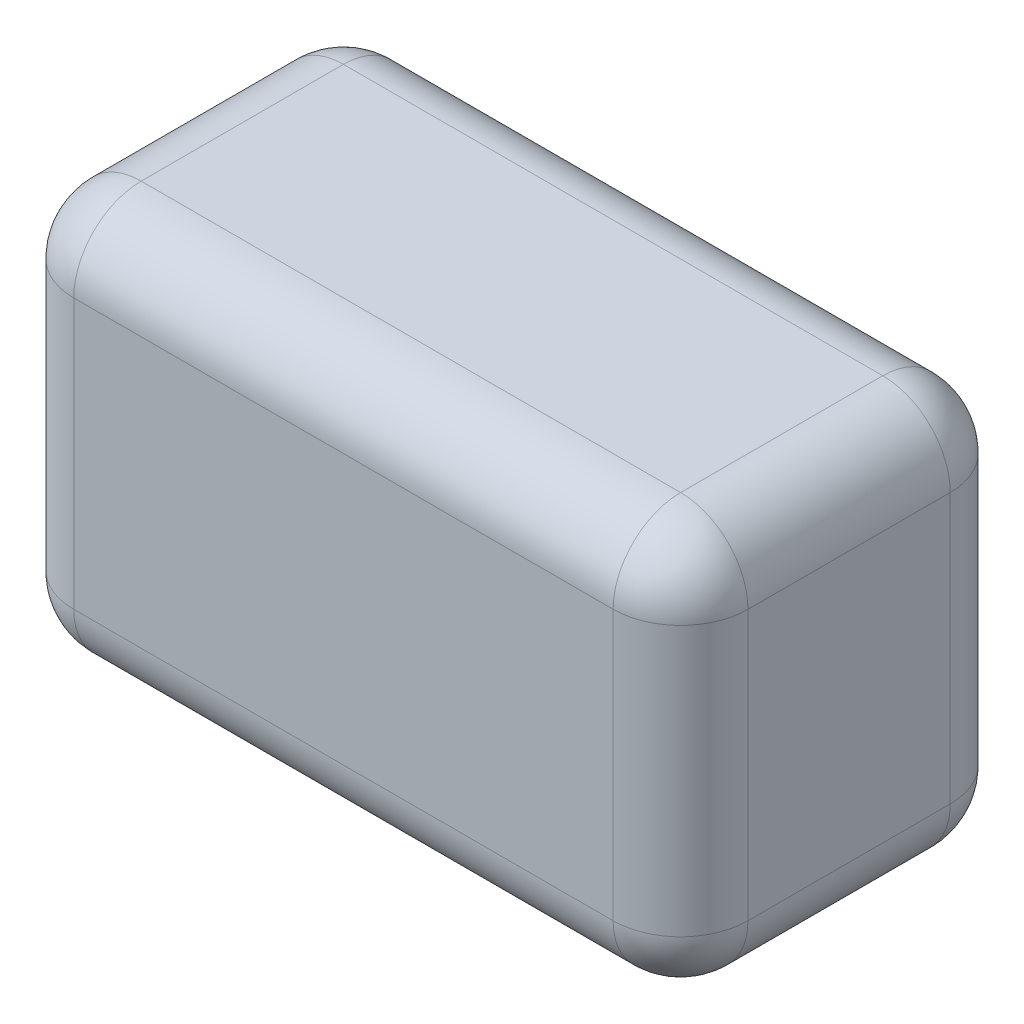
ISO-10303-21;
HEADER;
FILE_DESCRIPTION(('STEP AP214'),'2;1');
FILE_NAME('part.step','',(''),(''),'','','');
FILE_SCHEMA(('AUTOMOTIVE_DESIGN { 1 0 10303 214 1 1 1 1 }'));
ENDSEC;
DATA;
#1=APPLICATION_CONTEXT('core data for automotive mechanical design processes');
#2=APPLICATION_PROTOCOL_DEFINITION('international standard','automotive_design',2000,#1);
#3=PRODUCT_CONTEXT('',#1,'mechanical');
#4=PRODUCT('Part','Part','',(#3));
#5=PRODUCT_RELATED_PRODUCT_CATEGORY('part','',(#4));
#6=PRODUCT_DEFINITION_FORMATION('','',#4);
#7=PRODUCT_DEFINITION_CONTEXT('part definition',#1,'design');
#8=PRODUCT_DEFINITION('design','',#6,#7);
#9=PRODUCT_DEFINITION_SHAPE('','',#8);
#10=(LENGTH_UNIT() NAMED_UNIT(*) SI_UNIT(.MILLI.,.METRE.));
#11=(NAMED_UNIT(*) PLANE_ANGLE_UNIT() SI_UNIT($,.RADIAN.));
#12=(NAMED_UNIT(*) SI_UNIT($,.STERADIAN.) SOLID_ANGLE_UNIT());
#13=UNCERTAINTY_MEASURE_WITH_UNIT(LENGTH_MEASURE(1.E-05),#10,'distance_accuracy_value','');
#14=(GEOMETRIC_REPRESENTATION_CONTEXT(3) GLOBAL_UNCERTAINTY_ASSIGNED_CONTEXT((#13)) GLOBAL_UNIT_ASSIGNED_CONTEXT((#10,
#11,#12)) REPRESENTATION_CONTEXT('',''));
#15=CARTESIAN_POINT('',(0.,0.,0.));
#16=DIRECTION('',(0.,0.,1.));
#17=DIRECTION('',(1.,0.,0.));
#18=AXIS2_PLACEMENT_3D('',#15,#16,#17);
#19=CARTESIAN_POINT('',(127.,152.4,-63.5));
#20=DIRECTION('',(-1.,0.,0.));
#21=DIRECTION('',(0.,0.,1.));
#22=AXIS2_PLACEMENT_3D('',#19,#20,#21);
#23=PLANE('',#22);
#24=DIRECTION('',(0.,-1.,0.));
#25=VECTOR('',#24,1.);
#26=CARTESIAN_POINT('',(127.,152.4,38.1));
#27=LINE('',#26,#25);
#28=CARTESIAN_POINT('',(127.,127.,38.1));
#29=VERTEX_POINT('',#28);
#30=CARTESIAN_POINT('',(127.,25.4,38.1));
#31=VERTEX_POINT('',#30);
#32=EDGE_CURVE('E131',#29,#31,#27,.T.);
#33=ORIENTED_EDGE('',*,*,#32,.T.);
#34=DIRECTION('',(0.,0.,-1.));
#35=VECTOR('',#34,1.);
#36=CARTESIAN_POINT('',(127.,25.4,-63.5));
#37=LINE('',#36,#35);
#38=CARTESIAN_POINT('',(127.,25.4,-38.1));
#39=VERTEX_POINT('',#38);
#40=EDGE_CURVE('E176',#31,#39,#37,.T.);
#41=ORIENTED_EDGE('',*,*,#40,.T.);
#42=DIRECTION('',(0.,-1.,0.));
#43=VECTOR('',#42,1.);
#44=CARTESIAN_POINT('',(127.,152.4,-38.1));
#45=LINE('',#44,#43);
#46=CARTESIAN_POINT('',(127.,127.,-38.1));
#47=VERTEX_POINT('',#46);
#48=EDGE_CURVE('E134',#39,#47,#45,.F.);
#49=ORIENTED_EDGE('',*,*,#48,.T.);
#50=DIRECTION('',(0.,0.,-1.));
#51=VECTOR('',#50,1.);
#52=CARTESIAN_POINT('',(127.,127.,63.5));
#53=LINE('',#52,#51);
#54=EDGE_CURVE('E127',#47,#29,#53,.F.);
#55=ORIENTED_EDGE('',*,*,#54,.T.);
#56=EDGE_LOOP('',(#33,#41,#49,#55));
#57=FACE_BOUND('',#56,.T.);
#58=ADVANCED_FACE('F39',(#57),#23,.F.);
#59=CARTESIAN_POINT('',(-127.,152.4,-63.5));
#60=DIRECTION('',(0.,0.,1.));
#61=DIRECTION('',(1.,0.,0.));
#62=AXIS2_PLACEMENT_3D('',#59,#60,#61);
#63=PLANE('',#62);
#64=DIRECTION('',(-1.,0.,0.));
#65=VECTOR('',#64,1.);
#66=CARTESIAN_POINT('',(127.,127.,-63.5));
#67=LINE('',#66,#65);
#68=CARTESIAN_POINT('',(-101.6,127.,-63.5));
#69=VERTEX_POINT('',#68);
#70=CARTESIAN_POINT('',(101.6,127.,-63.5));
#71=VERTEX_POINT('',#70);
#72=EDGE_CURVE('E192',#69,#71,#67,.F.);
#73=ORIENTED_EDGE('',*,*,#72,.T.);
#74=DIRECTION('',(0.,-1.,0.));
#75=VECTOR('',#74,1.);
#76=CARTESIAN_POINT('',(101.6,152.4,-63.5));
#77=LINE('',#76,#75);
#78=CARTESIAN_POINT('',(101.6,25.4,-63.5));
#79=VERTEX_POINT('',#78);
#80=EDGE_CURVE('E201',#71,#79,#77,.T.);
#81=ORIENTED_EDGE('',*,*,#80,.T.);
#82=DIRECTION('',(-1.,0.,0.));
#83=VECTOR('',#82,1.);
#84=CARTESIAN_POINT('',(-127.,25.4,-63.5));
#85=LINE('',#84,#83);
#86=CARTESIAN_POINT('',(-101.6,25.4,-63.5));
#87=VERTEX_POINT('',#86);
#88=EDGE_CURVE('E198',#79,#87,#85,.T.);
#89=ORIENTED_EDGE('',*,*,#88,.T.);
#90=DIRECTION('',(0.,-1.,0.));
#91=VECTOR('',#90,1.);
#92=CARTESIAN_POINT('',(-101.6,152.4,-63.5));
#93=LINE('',#92,#91);
#94=EDGE_CURVE('E195',#87,#69,#93,.F.);
#95=ORIENTED_EDGE('',*,*,#94,.T.);
#96=EDGE_LOOP('',(#73,#81,#89,#95));
#97=FACE_BOUND('',#96,.T.);
#98=ADVANCED_FACE('F322',(#97),#63,.F.);
#99=CARTESIAN_POINT('',(-127.,152.4,-63.5));
#100=DIRECTION('',(1.,0.,0.));
#101=DIRECTION('',(0.,0.,-1.));
#102=AXIS2_PLACEMENT_3D('',#99,#100,#101);
#103=PLANE('',#102);
#104=DIRECTION('',(0.,0.,1.));
#105=VECTOR('',#104,1.);
#106=CARTESIAN_POINT('',(-127.,127.,-63.5));
#107=LINE('',#106,#105);
#108=CARTESIAN_POINT('',(-127.,127.,38.1));
#109=VERTEX_POINT('',#108);
#110=CARTESIAN_POINT('',(-127.,127.,-38.1));
#111=VERTEX_POINT('',#110);
#112=EDGE_CURVE('E208',#109,#111,#107,.F.);
#113=ORIENTED_EDGE('',*,*,#112,.T.);
#114=DIRECTION('',(0.,-1.,0.));
#115=VECTOR('',#114,1.);
#116=CARTESIAN_POINT('',(-127.,152.4,-38.1));
#117=LINE('',#116,#115);
#118=CARTESIAN_POINT('',(-127.,25.4,-38.1));
#119=VERTEX_POINT('',#118);
#120=EDGE_CURVE('E214',#111,#119,#117,.T.);
#121=ORIENTED_EDGE('',*,*,#120,.T.);
#122=DIRECTION('',(0.,0.,1.));
#123=VECTOR('',#122,1.);
#124=CARTESIAN_POINT('',(-127.,25.4,-63.5));
#125=LINE('',#124,#123);
#126=CARTESIAN_POINT('',(-127.,25.4,38.1));
#127=VERTEX_POINT('',#126);
#128=EDGE_CURVE('E211',#119,#127,#125,.T.);
#129=ORIENTED_EDGE('',*,*,#128,.T.);
#130=DIRECTION('',(0.,-1.,0.));
#131=VECTOR('',#130,1.);
#132=CARTESIAN_POINT('',(-127.,152.4,38.1));
#133=LINE('',#132,#131);
#134=EDGE_CURVE('E205',#127,#109,#133,.F.);
#135=ORIENTED_EDGE('',*,*,#134,.T.);
#136=EDGE_LOOP('',(#113,#121,#129,#135));
#137=FACE_BOUND('',#136,.T.);
#138=ADVANCED_FACE('F331',(#137),#103,.F.);
#139=CARTESIAN_POINT('',(-127.,152.4,63.5));
#140=DIRECTION('',(0.,0.,-1.));
#141=DIRECTION('',(-1.,0.,0.));
#142=AXIS2_PLACEMENT_3D('',#139,#140,#141);
#143=PLANE('',#142);
#144=DIRECTION('',(1.,0.,0.));
#145=VECTOR('',#144,1.);
#146=CARTESIAN_POINT('',(-127.,127.,63.5));
#147=LINE('',#146,#145);
#148=CARTESIAN_POINT('',(101.6,127.,63.5));
#149=VERTEX_POINT('',#148);
#150=CARTESIAN_POINT('',(-101.6,127.,63.5));
#151=VERTEX_POINT('',#150);
#152=EDGE_CURVE('E49',#149,#151,#147,.F.);
#153=ORIENTED_EDGE('',*,*,#152,.T.);
#154=DIRECTION('',(0.,-1.,0.));
#155=VECTOR('',#154,1.);
#156=CARTESIAN_POINT('',(-101.6,152.4,63.5));
#157=LINE('',#156,#155);
#158=CARTESIAN_POINT('',(-101.6,25.4,63.5));
#159=VERTEX_POINT('',#158);
#160=EDGE_CURVE('E11',#151,#159,#157,.T.);
#161=ORIENTED_EDGE('',*,*,#160,.T.);
#162=DIRECTION('',(1.,0.,0.));
#163=VECTOR('',#162,1.);
#164=CARTESIAN_POINT('',(-127.,25.4,63.5));
#165=LINE('',#164,#163);
#166=CARTESIAN_POINT('',(101.6,25.4,63.5));
#167=VERTEX_POINT('',#166);
#168=EDGE_CURVE('E230',#159,#167,#165,.T.);
#169=ORIENTED_EDGE('',*,*,#168,.T.);
#170=DIRECTION('',(0.,-1.,0.));
#171=VECTOR('',#170,1.);
#172=CARTESIAN_POINT('',(101.6,152.4,63.5));
#173=LINE('',#172,#171);
#174=EDGE_CURVE('E60',#167,#149,#173,.F.);
#175=ORIENTED_EDGE('',*,*,#174,.T.);
#176=EDGE_LOOP('',(#153,#161,#169,#175));
#177=FACE_BOUND('',#176,.T.);
#178=ADVANCED_FACE('F343',(#177),#143,.F.);
#179=CARTESIAN_POINT('',(0.,152.4,0.));
#180=DIRECTION('',(0.,1.,0.));
#181=DIRECTION('',(0.,0.,1.));
#182=AXIS2_PLACEMENT_3D('',#179,#180,#181);
#183=PLANE('',#182);
#184=DIRECTION('',(-1.,0.,0.));
#185=VECTOR('',#184,1.);
#186=CARTESIAN_POINT('',(-127.,152.4,-38.1));
#187=LINE('',#186,#185);
#188=CARTESIAN_POINT('',(101.6,152.4,-38.1));
#189=VERTEX_POINT('',#188);
#190=CARTESIAN_POINT('',(-101.6,152.4,-38.1));
#191=VERTEX_POINT('',#190);
#192=EDGE_CURVE('E223',#189,#191,#187,.T.);
#193=ORIENTED_EDGE('',*,*,#192,.T.);
#194=DIRECTION('',(0.,0.,1.));
#195=VECTOR('',#194,1.);
#196=CARTESIAN_POINT('',(-101.6,152.4,63.5));
#197=LINE('',#196,#195);
#198=CARTESIAN_POINT('',(-101.6,152.4,38.1));
#199=VERTEX_POINT('',#198);
#200=EDGE_CURVE('E226',#191,#199,#197,.T.);
#201=ORIENTED_EDGE('',*,*,#200,.T.);
#202=DIRECTION('',(1.,0.,0.));
#203=VECTOR('',#202,1.);
#204=CARTESIAN_POINT('',(127.,152.4,38.1));
#205=LINE('',#204,#203);
#206=CARTESIAN_POINT('',(101.6,152.4,38.1));
#207=VERTEX_POINT('',#206);
#208=EDGE_CURVE('E218',#199,#207,#205,.T.);
#209=ORIENTED_EDGE('',*,*,#208,.T.);
#210=DIRECTION('',(0.,0.,-1.));
#211=VECTOR('',#210,1.);
#212=CARTESIAN_POINT('',(101.6,152.4,-63.5));
#213=LINE('',#212,#211);
#214=EDGE_CURVE('E145',#207,#189,#213,.T.);
#215=ORIENTED_EDGE('',*,*,#214,.T.);
#216=EDGE_LOOP('',(#193,#201,#209,#215));
#217=FACE_BOUND('',#216,.T.);
#218=ADVANCED_FACE('F576',(#217),#183,.T.);
#219=CARTESIAN_POINT('',(0.,0.,0.));
#220=DIRECTION('',(0.,1.,0.));
#221=DIRECTION('',(0.,0.,1.));
#222=AXIS2_PLACEMENT_3D('',#219,#220,#221);
#223=PLANE('',#222);
#224=CARTESIAN_POINT('',(50.8,0.,0.));
#225=DIRECTION('',(0.,1.,0.));
#226=DIRECTION('',(0.,0.,-1.));
#227=AXIS2_PLACEMENT_3D('',#224,#225,#226);
#228=CIRCLE('',#227,3.81);
#229=CARTESIAN_POINT('',(50.8,0.,-3.81));
#230=VERTEX_POINT('',#229);
#231=EDGE_CURVE('E627',#230,#230,#228,.T.);
#232=ORIENTED_EDGE('',*,*,#231,.T.);
#233=EDGE_LOOP('',(#232));
#234=FACE_BOUND('',#233,.T.);
#235=CARTESIAN_POINT('',(-50.8,0.,0.));
#236=DIRECTION('',(0.,-1.,0.));
#237=DIRECTION('',(0.,0.,-1.));
#238=AXIS2_PLACEMENT_3D('',#235,#236,#237);
#239=CIRCLE('',#238,3.81);
#240=CARTESIAN_POINT('',(-50.8,0.,-3.81));
#241=VERTEX_POINT('',#240);
#242=EDGE_CURVE('E171',#241,#241,#239,.T.);
#243=ORIENTED_EDGE('',*,*,#242,.F.);
#244=EDGE_LOOP('',(#243));
#245=FACE_BOUND('',#244,.T.);
#246=DIRECTION('',(-1.,0.,0.));
#247=VECTOR('',#246,1.);
#248=CARTESIAN_POINT('',(0.,0.,-38.1));
#249=LINE('',#248,#247);
#250=CARTESIAN_POINT('',(-101.6,0.,-38.1));
#251=VERTEX_POINT('',#250);
#252=CARTESIAN_POINT('',(101.6,0.,-38.1));
#253=VERTEX_POINT('',#252);
#254=EDGE_CURVE('E185',#251,#253,#249,.F.);
#255=ORIENTED_EDGE('',*,*,#254,.T.);
#256=DIRECTION('',(0.,0.,-1.));
#257=VECTOR('',#256,1.);
#258=CARTESIAN_POINT('',(101.6,0.,0.));
#259=LINE('',#258,#257);
#260=CARTESIAN_POINT('',(101.6,0.,38.1));
#261=VERTEX_POINT('',#260);
#262=EDGE_CURVE('E188',#253,#261,#259,.F.);
#263=ORIENTED_EDGE('',*,*,#262,.T.);
#264=DIRECTION('',(1.,0.,0.));
#265=VECTOR('',#264,1.);
#266=CARTESIAN_POINT('',(0.,0.,38.1));
#267=LINE('',#266,#265);
#268=CARTESIAN_POINT('',(-101.6,0.,38.1));
#269=VERTEX_POINT('',#268);
#270=EDGE_CURVE('E179',#261,#269,#267,.F.);
#271=ORIENTED_EDGE('',*,*,#270,.T.);
#272=DIRECTION('',(0.,0.,1.));
#273=VECTOR('',#272,1.);
#274=CARTESIAN_POINT('',(-101.6,0.,0.));
#275=LINE('',#274,#273);
#276=EDGE_CURVE('E182',#269,#251,#275,.F.);
#277=ORIENTED_EDGE('',*,*,#276,.T.);
#278=EDGE_LOOP('',(#255,#263,#271,#277));
#279=FACE_BOUND('',#278,.T.);
#280=ADVANCED_FACE('F569',(#234,#245,#279),#223,.F.);
#281=CARTESIAN_POINT('',(-101.6,127.,0.));
#282=DIRECTION('',(0.,0.,-1.));
#283=DIRECTION('',(-1.,0.,0.));
#284=AXIS2_PLACEMENT_3D('',#281,#282,#283);
#285=CYLINDRICAL_SURFACE('',#284,25.4);
#286=CARTESIAN_POINT('',(-101.6,127.,38.1));
#287=DIRECTION('',(0.,0.,1.));
#288=DIRECTION('',(1.,0.,0.));
#289=AXIS2_PLACEMENT_3D('',#286,#287,#288);
#290=CIRCLE('',#289,25.4);
#291=EDGE_CURVE('E43',#199,#109,#290,.T.);
#292=ORIENTED_EDGE('',*,*,#291,.F.);
#293=ORIENTED_EDGE('',*,*,#200,.F.);
#294=CARTESIAN_POINT('',(-101.6,127.,-38.1));
#295=DIRECTION('',(0.,0.,-1.));
#296=DIRECTION('',(-1.,0.,0.));
#297=AXIS2_PLACEMENT_3D('',#294,#295,#296);
#298=CIRCLE('',#297,25.4);
#299=EDGE_CURVE('E169',#111,#191,#298,.T.);
#300=ORIENTED_EDGE('',*,*,#299,.F.);
#301=ORIENTED_EDGE('',*,*,#112,.F.);
#302=EDGE_LOOP('',(#292,#293,#300,#301));
#303=FACE_BOUND('',#302,.T.);
#304=ADVANCED_FACE('F41',(#303),#285,.T.);
#305=CARTESIAN_POINT('',(-101.6,127.,38.1));
#306=DIRECTION('',(0.,0.,1.));
#307=DIRECTION('',(1.,0.,0.));
#308=AXIS2_PLACEMENT_3D('',#305,#306,#307);
#309=SPHERICAL_SURFACE('',#308,25.4);
#310=CARTESIAN_POINT('',(-101.6,127.,38.1));
#311=DIRECTION('',(-1.,0.,0.));
#312=DIRECTION('',(0.,0.,1.));
#313=AXIS2_PLACEMENT_3D('',#310,#311,#312);
#314=CIRCLE('',#313,25.4);
#315=EDGE_CURVE('E298',#199,#151,#314,.F.);
#316=ORIENTED_EDGE('',*,*,#315,.F.);
#317=ORIENTED_EDGE('',*,*,#291,.T.);
#318=CARTESIAN_POINT('',(-101.6,127.,38.1));
#319=DIRECTION('',(0.,1.,0.));
#320=DIRECTION('',(0.,0.,1.));
#321=AXIS2_PLACEMENT_3D('',#318,#319,#320);
#322=CIRCLE('',#321,25.4);
#323=EDGE_CURVE('E301',#151,#109,#322,.F.);
#324=ORIENTED_EDGE('',*,*,#323,.F.);
#325=EDGE_LOOP('',(#316,#317,#324));
#326=FACE_BOUND('',#325,.T.);
#327=ADVANCED_FACE('F337',(#326),#309,.T.);
#328=CARTESIAN_POINT('',(-101.6,127.,-38.1));
#329=DIRECTION('',(0.,0.,1.));
#330=DIRECTION('',(1.,0.,0.));
#331=AXIS2_PLACEMENT_3D('',#328,#329,#330);
#332=SPHERICAL_SURFACE('',#331,25.4);
#333=CARTESIAN_POINT('',(-101.6,127.,-38.1));
#334=DIRECTION('',(0.,1.,0.));
#335=DIRECTION('',(0.,0.,1.));
#336=AXIS2_PLACEMENT_3D('',#333,#334,#335);
#337=CIRCLE('',#336,25.4);
#338=EDGE_CURVE('E290',#111,#69,#337,.F.);
#339=ORIENTED_EDGE('',*,*,#338,.F.);
#340=ORIENTED_EDGE('',*,*,#299,.T.);
#341=CARTESIAN_POINT('',(-101.6,127.,-38.1));
#342=DIRECTION('',(-1.,0.,0.));
#343=DIRECTION('',(0.,0.,1.));
#344=AXIS2_PLACEMENT_3D('',#341,#342,#343);
#345=CIRCLE('',#344,25.4);
#346=EDGE_CURVE('E294',#69,#191,#345,.F.);
#347=ORIENTED_EDGE('',*,*,#346,.F.);
#348=EDGE_LOOP('',(#339,#340,#347));
#349=FACE_BOUND('',#348,.T.);
#350=ADVANCED_FACE('F310',(#349),#332,.T.);
#351=CARTESIAN_POINT('',(-101.6,152.4,38.1));
#352=DIRECTION('',(0.,-1.,0.));
#353=DIRECTION('',(0.,0.,-1.));
#354=AXIS2_PLACEMENT_3D('',#351,#352,#353);
#355=CYLINDRICAL_SURFACE('',#354,25.4);
#356=ORIENTED_EDGE('',*,*,#323,.T.);
#357=ORIENTED_EDGE('',*,*,#134,.F.);
#358=CARTESIAN_POINT('',(-101.6,25.4,38.1));
#359=DIRECTION('',(0.,-1.,0.));
#360=DIRECTION('',(0.,0.,-1.));
#361=AXIS2_PLACEMENT_3D('',#358,#359,#360);
#362=CIRCLE('',#361,25.4);
#363=EDGE_CURVE('E282',#159,#127,#362,.T.);
#364=ORIENTED_EDGE('',*,*,#363,.F.);
#365=ORIENTED_EDGE('',*,*,#160,.F.);
#366=EDGE_LOOP('',(#356,#357,#364,#365));
#367=FACE_BOUND('',#366,.T.);
#368=ADVANCED_FACE('F340',(#367),#355,.T.);
#369=CARTESIAN_POINT('',(0.,127.,38.1));
#370=DIRECTION('',(-1.,0.,0.));
#371=DIRECTION('',(0.,0.,1.));
#372=AXIS2_PLACEMENT_3D('',#369,#370,#371);
#373=CYLINDRICAL_SURFACE('',#372,25.4);
#374=ORIENTED_EDGE('',*,*,#315,.T.);
#375=ORIENTED_EDGE('',*,*,#152,.F.);
#376=CARTESIAN_POINT('',(101.6,127.,38.1));
#377=DIRECTION('',(1.,0.,0.));
#378=DIRECTION('',(0.,0.,-1.));
#379=AXIS2_PLACEMENT_3D('',#376,#377,#378);
#380=CIRCLE('',#379,25.4);
#381=EDGE_CURVE('E150',#207,#149,#380,.T.);
#382=ORIENTED_EDGE('',*,*,#381,.F.);
#383=ORIENTED_EDGE('',*,*,#208,.F.);
#384=EDGE_LOOP('',(#374,#375,#382,#383));
#385=FACE_BOUND('',#384,.T.);
#386=ADVANCED_FACE('F533',(#385),#373,.T.);
#387=CARTESIAN_POINT('',(101.6,127.,0.));
#388=DIRECTION('',(0.,0.,1.));
#389=DIRECTION('',(1.,0.,0.));
#390=AXIS2_PLACEMENT_3D('',#387,#388,#389);
#391=CYLINDRICAL_SURFACE('',#390,25.4);
#392=CARTESIAN_POINT('',(101.6,127.,-38.1));
#393=DIRECTION('',(0.,0.,-1.));
#394=DIRECTION('',(-1.,0.,0.));
#395=AXIS2_PLACEMENT_3D('',#392,#393,#394);
#396=CIRCLE('',#395,25.4);
#397=EDGE_CURVE('E151',#189,#47,#396,.T.);
#398=ORIENTED_EDGE('',*,*,#397,.F.);
#399=ORIENTED_EDGE('',*,*,#214,.F.);
#400=CARTESIAN_POINT('',(101.6,127.,38.1));
#401=DIRECTION('',(0.,0.,1.));
#402=DIRECTION('',(1.,0.,0.));
#403=AXIS2_PLACEMENT_3D('',#400,#401,#402);
#404=CIRCLE('',#403,25.4);
#405=EDGE_CURVE('E142',#29,#207,#404,.T.);
#406=ORIENTED_EDGE('',*,*,#405,.F.);
#407=ORIENTED_EDGE('',*,*,#54,.F.);
#408=EDGE_LOOP('',(#398,#399,#406,#407));
#409=FACE_BOUND('',#408,.T.);
#410=ADVANCED_FACE('F144',(#409),#391,.T.);
#411=CARTESIAN_POINT('',(0.,127.,-38.1));
#412=DIRECTION('',(1.,0.,0.));
#413=DIRECTION('',(0.,0.,-1.));
#414=AXIS2_PLACEMENT_3D('',#411,#412,#413);
#415=CYLINDRICAL_SURFACE('',#414,25.4);
#416=ORIENTED_EDGE('',*,*,#346,.T.);
#417=ORIENTED_EDGE('',*,*,#192,.F.);
#418=CARTESIAN_POINT('',(101.6,127.,-38.1));
#419=DIRECTION('',(1.,0.,0.));
#420=DIRECTION('',(0.,1.,0.));
#421=AXIS2_PLACEMENT_3D('',#418,#419,#420);
#422=CIRCLE('',#421,25.4);
#423=EDGE_CURVE('E274',#71,#189,#422,.T.);
#424=ORIENTED_EDGE('',*,*,#423,.F.);
#425=ORIENTED_EDGE('',*,*,#72,.F.);
#426=EDGE_LOOP('',(#416,#417,#424,#425));
#427=FACE_BOUND('',#426,.T.);
#428=ADVANCED_FACE('F318',(#427),#415,.T.);
#429=CARTESIAN_POINT('',(-101.6,152.4,-38.1));
#430=DIRECTION('',(0.,-1.,0.));
#431=DIRECTION('',(0.,0.,-1.));
#432=AXIS2_PLACEMENT_3D('',#429,#430,#431);
#433=CYLINDRICAL_SURFACE('',#432,25.4);
#434=ORIENTED_EDGE('',*,*,#338,.T.);
#435=ORIENTED_EDGE('',*,*,#94,.F.);
#436=CARTESIAN_POINT('',(-101.6,25.4,-38.1));
#437=DIRECTION('',(0.,-1.,0.));
#438=DIRECTION('',(0.,0.,-1.));
#439=AXIS2_PLACEMENT_3D('',#436,#437,#438);
#440=CIRCLE('',#439,25.4);
#441=EDGE_CURVE('E270',#119,#87,#440,.T.);
#442=ORIENTED_EDGE('',*,*,#441,.F.);
#443=ORIENTED_EDGE('',*,*,#120,.F.);
#444=EDGE_LOOP('',(#434,#435,#442,#443));
#445=FACE_BOUND('',#444,.T.);
#446=ADVANCED_FACE('F328',(#445),#433,.T.);
#447=CARTESIAN_POINT('',(-101.6,25.4,-63.5));
#448=DIRECTION('',(0.,0.,1.));
#449=DIRECTION('',(1.,0.,0.));
#450=AXIS2_PLACEMENT_3D('',#447,#448,#449);
#451=CYLINDRICAL_SURFACE('',#450,25.4);
#452=CARTESIAN_POINT('',(-101.6,25.4,38.1));
#453=DIRECTION('',(0.,0.,1.));
#454=DIRECTION('',(1.,0.,0.));
#455=AXIS2_PLACEMENT_3D('',#452,#453,#454);
#456=CIRCLE('',#455,25.4);
#457=EDGE_CURVE('E286',#127,#269,#456,.T.);
#458=ORIENTED_EDGE('',*,*,#457,.F.);
#459=ORIENTED_EDGE('',*,*,#128,.F.);
#460=CARTESIAN_POINT('',(-101.6,25.4,-38.1));
#461=DIRECTION('',(0.,0.,-1.));
#462=DIRECTION('',(-1.,0.,0.));
#463=AXIS2_PLACEMENT_3D('',#460,#461,#462);
#464=CIRCLE('',#463,25.4);
#465=EDGE_CURVE('E267',#251,#119,#464,.T.);
#466=ORIENTED_EDGE('',*,*,#465,.F.);
#467=ORIENTED_EDGE('',*,*,#276,.F.);
#468=EDGE_LOOP('',(#458,#459,#466,#467));
#469=FACE_BOUND('',#468,.T.);
#470=ADVANCED_FACE('F502',(#469),#451,.T.);
#471=CARTESIAN_POINT('',(-101.6,25.4,38.1));
#472=DIRECTION('',(0.,0.,1.));
#473=DIRECTION('',(1.,0.,0.));
#474=AXIS2_PLACEMENT_3D('',#471,#472,#473);
#475=SPHERICAL_SURFACE('',#474,25.4);
#476=ORIENTED_EDGE('',*,*,#363,.T.);
#477=ORIENTED_EDGE('',*,*,#457,.T.);
#478=CARTESIAN_POINT('',(-101.6,25.4,38.1));
#479=DIRECTION('',(-1.,0.,0.));
#480=DIRECTION('',(0.,0.,1.));
#481=AXIS2_PLACEMENT_3D('',#478,#479,#480);
#482=CIRCLE('',#481,25.4);
#483=EDGE_CURVE('E158',#159,#269,#482,.F.);
#484=ORIENTED_EDGE('',*,*,#483,.F.);
#485=EDGE_LOOP('',(#476,#477,#484));
#486=FACE_BOUND('',#485,.T.);
#487=ADVANCED_FACE('F373',(#486),#475,.T.);
#488=CARTESIAN_POINT('',(101.6,127.,38.1));
#489=DIRECTION('',(0.,0.,1.));
#490=DIRECTION('',(1.,0.,0.));
#491=AXIS2_PLACEMENT_3D('',#488,#489,#490);
#492=SPHERICAL_SURFACE('',#491,25.4);
#493=ORIENTED_EDGE('',*,*,#405,.T.);
#494=ORIENTED_EDGE('',*,*,#381,.T.);
#495=CARTESIAN_POINT('',(101.6,127.,38.1));
#496=DIRECTION('',(0.,1.,0.));
#497=DIRECTION('',(0.,0.,1.));
#498=AXIS2_PLACEMENT_3D('',#495,#496,#497);
#499=CIRCLE('',#498,25.4);
#500=EDGE_CURVE('E154',#29,#149,#499,.F.);
#501=ORIENTED_EDGE('',*,*,#500,.F.);
#502=EDGE_LOOP('',(#493,#494,#501));
#503=FACE_BOUND('',#502,.T.);
#504=ADVANCED_FACE('F155',(#503),#492,.T.);
#505=CARTESIAN_POINT('',(101.6,127.,-38.1));
#506=DIRECTION('',(0.,0.,1.));
#507=DIRECTION('',(1.,0.,0.));
#508=AXIS2_PLACEMENT_3D('',#505,#506,#507);
#509=SPHERICAL_SURFACE('',#508,25.4);
#510=ORIENTED_EDGE('',*,*,#423,.T.);
#511=ORIENTED_EDGE('',*,*,#397,.T.);
#512=CARTESIAN_POINT('',(101.6,127.,-38.1));
#513=DIRECTION('',(0.,1.,0.));
#514=DIRECTION('',(0.,0.,1.));
#515=AXIS2_PLACEMENT_3D('',#512,#513,#514);
#516=CIRCLE('',#515,25.4);
#517=EDGE_CURVE('E159',#71,#47,#516,.F.);
#518=ORIENTED_EDGE('',*,*,#517,.F.);
#519=EDGE_LOOP('',(#510,#511,#518));
#520=FACE_BOUND('',#519,.T.);
#521=ADVANCED_FACE('F363',(#520),#509,.T.);
#522=CARTESIAN_POINT('',(-101.6,25.4,-38.1));
#523=DIRECTION('',(0.,0.,1.));
#524=DIRECTION('',(1.,0.,0.));
#525=AXIS2_PLACEMENT_3D('',#522,#523,#524);
#526=SPHERICAL_SURFACE('',#525,25.4);
#527=ORIENTED_EDGE('',*,*,#465,.T.);
#528=ORIENTED_EDGE('',*,*,#441,.T.);
#529=CARTESIAN_POINT('',(-101.6,25.4,-38.1));
#530=DIRECTION('',(-1.,0.,0.));
#531=DIRECTION('',(0.,0.,1.));
#532=AXIS2_PLACEMENT_3D('',#529,#530,#531);
#533=CIRCLE('',#532,25.4);
#534=EDGE_CURVE('E257',#251,#87,#533,.F.);
#535=ORIENTED_EDGE('',*,*,#534,.F.);
#536=EDGE_LOOP('',(#527,#528,#535));
#537=FACE_BOUND('',#536,.T.);
#538=ADVANCED_FACE('F365',(#537),#526,.T.);
#539=CARTESIAN_POINT('',(-127.,25.4,38.1));
#540=DIRECTION('',(1.,0.,0.));
#541=DIRECTION('',(0.,0.,-1.));
#542=AXIS2_PLACEMENT_3D('',#539,#540,#541);
#543=CYLINDRICAL_SURFACE('',#542,25.4);
#544=ORIENTED_EDGE('',*,*,#483,.T.);
#545=ORIENTED_EDGE('',*,*,#270,.F.);
#546=CARTESIAN_POINT('',(101.6,25.4,38.1));
#547=DIRECTION('',(1.,0.,0.));
#548=DIRECTION('',(0.,0.,-1.));
#549=AXIS2_PLACEMENT_3D('',#546,#547,#548);
#550=CIRCLE('',#549,25.4);
#551=EDGE_CURVE('E253',#167,#261,#550,.T.);
#552=ORIENTED_EDGE('',*,*,#551,.F.);
#553=ORIENTED_EDGE('',*,*,#168,.F.);
#554=EDGE_LOOP('',(#544,#545,#552,#553));
#555=FACE_BOUND('',#554,.T.);
#556=ADVANCED_FACE('F348',(#555),#543,.T.);
#557=CARTESIAN_POINT('',(101.6,152.4,38.1));
#558=DIRECTION('',(0.,-1.,0.));
#559=DIRECTION('',(0.,0.,-1.));
#560=AXIS2_PLACEMENT_3D('',#557,#558,#559);
#561=CYLINDRICAL_SURFACE('',#560,25.4);
#562=ORIENTED_EDGE('',*,*,#500,.T.);
#563=ORIENTED_EDGE('',*,*,#174,.F.);
#564=CARTESIAN_POINT('',(101.6,25.4,38.1));
#565=DIRECTION('',(0.,-1.,0.));
#566=DIRECTION('',(0.,0.,-1.));
#567=AXIS2_PLACEMENT_3D('',#564,#565,#566);
#568=CIRCLE('',#567,25.4);
#569=EDGE_CURVE('E163',#31,#167,#568,.T.);
#570=ORIENTED_EDGE('',*,*,#569,.F.);
#571=ORIENTED_EDGE('',*,*,#32,.F.);
#572=EDGE_LOOP('',(#562,#563,#570,#571));
#573=FACE_BOUND('',#572,.T.);
#574=ADVANCED_FACE('F161',(#573),#561,.T.);
#575=CARTESIAN_POINT('',(101.6,152.4,-38.1));
#576=DIRECTION('',(0.,-1.,0.));
#577=DIRECTION('',(0.,0.,-1.));
#578=AXIS2_PLACEMENT_3D('',#575,#576,#577);
#579=CYLINDRICAL_SURFACE('',#578,25.4);
#580=ORIENTED_EDGE('',*,*,#517,.T.);
#581=ORIENTED_EDGE('',*,*,#48,.F.);
#582=CARTESIAN_POINT('',(101.6,25.4,-38.1));
#583=DIRECTION('',(0.,-1.,0.));
#584=DIRECTION('',(0.,0.,-1.));
#585=AXIS2_PLACEMENT_3D('',#582,#583,#584);
#586=CIRCLE('',#585,25.4);
#587=EDGE_CURVE('E247',#79,#39,#586,.T.);
#588=ORIENTED_EDGE('',*,*,#587,.F.);
#589=ORIENTED_EDGE('',*,*,#80,.F.);
#590=EDGE_LOOP('',(#580,#581,#588,#589));
#591=FACE_BOUND('',#590,.T.);
#592=ADVANCED_FACE('F361',(#591),#579,.T.);
#593=CARTESIAN_POINT('',(-127.,25.4,-38.1));
#594=DIRECTION('',(-1.,0.,0.));
#595=DIRECTION('',(0.,0.,1.));
#596=AXIS2_PLACEMENT_3D('',#593,#594,#595);
#597=CYLINDRICAL_SURFACE('',#596,25.4);
#598=ORIENTED_EDGE('',*,*,#534,.T.);
#599=ORIENTED_EDGE('',*,*,#88,.F.);
#600=CARTESIAN_POINT('',(101.6,25.4,-38.1));
#601=DIRECTION('',(1.,0.,0.));
#602=DIRECTION('',(0.,0.,-1.));
#603=AXIS2_PLACEMENT_3D('',#600,#601,#602);
#604=CIRCLE('',#603,25.4);
#605=EDGE_CURVE('E244',#253,#79,#604,.T.);
#606=ORIENTED_EDGE('',*,*,#605,.F.);
#607=ORIENTED_EDGE('',*,*,#254,.F.);
#608=EDGE_LOOP('',(#598,#599,#606,#607));
#609=FACE_BOUND('',#608,.T.);
#610=ADVANCED_FACE('F390',(#609),#597,.T.);
#611=CARTESIAN_POINT('',(101.6,25.4,38.1));
#612=DIRECTION('',(0.,0.,1.));
#613=DIRECTION('',(1.,0.,0.));
#614=AXIS2_PLACEMENT_3D('',#611,#612,#613);
#615=SPHERICAL_SURFACE('',#614,25.4);
#616=ORIENTED_EDGE('',*,*,#569,.T.);
#617=ORIENTED_EDGE('',*,*,#551,.T.);
#618=CARTESIAN_POINT('',(101.6,25.4,38.1));
#619=DIRECTION('',(0.,0.,1.));
#620=DIRECTION('',(1.,0.,0.));
#621=AXIS2_PLACEMENT_3D('',#618,#619,#620);
#622=CIRCLE('',#621,25.4);
#623=EDGE_CURVE('E240',#31,#261,#622,.F.);
#624=ORIENTED_EDGE('',*,*,#623,.F.);
#625=EDGE_LOOP('',(#616,#617,#624));
#626=FACE_BOUND('',#625,.T.);
#627=ADVANCED_FACE('F350',(#626),#615,.T.);
#628=CARTESIAN_POINT('',(101.6,25.4,-38.1));
#629=DIRECTION('',(0.,0.,1.));
#630=DIRECTION('',(1.,0.,0.));
#631=AXIS2_PLACEMENT_3D('',#628,#629,#630);
#632=SPHERICAL_SURFACE('',#631,25.4);
#633=ORIENTED_EDGE('',*,*,#605,.T.);
#634=ORIENTED_EDGE('',*,*,#587,.T.);
#635=CARTESIAN_POINT('',(101.6,25.4,-38.1));
#636=DIRECTION('',(0.,0.,-1.));
#637=DIRECTION('',(-1.,0.,0.));
#638=AXIS2_PLACEMENT_3D('',#635,#636,#637);
#639=CIRCLE('',#638,25.4);
#640=EDGE_CURVE('E237',#253,#39,#639,.F.);
#641=ORIENTED_EDGE('',*,*,#640,.F.);
#642=EDGE_LOOP('',(#633,#634,#641));
#643=FACE_BOUND('',#642,.T.);
#644=ADVANCED_FACE('F358',(#643),#632,.T.);
#645=CARTESIAN_POINT('',(101.6,25.4,-63.5));
#646=DIRECTION('',(0.,0.,-1.));
#647=DIRECTION('',(-1.,0.,0.));
#648=AXIS2_PLACEMENT_3D('',#645,#646,#647);
#649=CYLINDRICAL_SURFACE('',#648,25.4);
#650=ORIENTED_EDGE('',*,*,#623,.T.);
#651=ORIENTED_EDGE('',*,*,#262,.F.);
#652=ORIENTED_EDGE('',*,*,#640,.T.);
#653=ORIENTED_EDGE('',*,*,#40,.F.);
#654=EDGE_LOOP('',(#650,#651,#652,#653));
#655=FACE_BOUND('',#654,.T.);
#656=ADVANCED_FACE('F354',(#655),#649,.T.);
#657=CARTESIAN_POINT('',(-50.8,8.89,0.));
#658=DIRECTION('',(0.,-1.,0.));
#659=DIRECTION('',(0.,0.,-1.));
#660=AXIS2_PLACEMENT_3D('',#657,#658,#659);
#661=CYLINDRICAL_SURFACE('',#660,3.81);
#662=CARTESIAN_POINT('',(-50.8,8.89,0.));
#663=DIRECTION('',(0.,-1.,0.));
#664=DIRECTION('',(0.,0.,-1.));
#665=AXIS2_PLACEMENT_3D('',#662,#663,#664);
#666=CIRCLE('',#665,3.81);
#667=CARTESIAN_POINT('',(-50.8,8.89,-3.81));
#668=VERTEX_POINT('',#667);
#669=EDGE_CURVE('E241',#668,#668,#666,.T.);
#670=ORIENTED_EDGE('',*,*,#669,.F.);
#671=EDGE_LOOP('',(#670));
#672=FACE_BOUND('',#671,.T.);
#673=ORIENTED_EDGE('',*,*,#242,.T.);
#674=EDGE_LOOP('',(#673));
#675=FACE_BOUND('',#674,.T.);
#676=ADVANCED_FACE('F385',(#672,#675),#661,.F.);
#677=CARTESIAN_POINT('',(-50.8,8.89,0.));
#678=DIRECTION('',(0.,-1.,0.));
#679=DIRECTION('',(0.,0.,-1.));
#680=AXIS2_PLACEMENT_3D('',#677,#678,#679);
#681=PLANE('',#680);
#682=ORIENTED_EDGE('',*,*,#669,.T.);
#683=EDGE_LOOP('',(#682));
#684=FACE_BOUND('',#683,.T.);
#685=ADVANCED_FACE('F433',(#684),#681,.T.);
#686=CARTESIAN_POINT('',(50.8,8.89,0.));
#687=DIRECTION('',(0.,-1.,0.));
#688=DIRECTION('',(0.,0.,-1.));
#689=AXIS2_PLACEMENT_3D('',#686,#687,#688);
#690=CYLINDRICAL_SURFACE('',#689,3.81);
#691=CARTESIAN_POINT('',(50.8,8.89,0.));
#692=DIRECTION('',(0.,1.,0.));
#693=DIRECTION('',(0.,0.,-1.));
#694=AXIS2_PLACEMENT_3D('',#691,#692,#693);
#695=CIRCLE('',#694,3.81);
#696=CARTESIAN_POINT('',(50.8,8.89,-3.81));
#697=VERTEX_POINT('',#696);
#698=EDGE_CURVE('E637',#697,#697,#695,.T.);
#699=ORIENTED_EDGE('',*,*,#698,.T.);
#700=EDGE_LOOP('',(#699));
#701=FACE_BOUND('',#700,.T.);
#702=ORIENTED_EDGE('',*,*,#231,.F.);
#703=EDGE_LOOP('',(#702));
#704=FACE_BOUND('',#703,.T.);
#705=ADVANCED_FACE('F441',(#701,#704),#690,.F.);
#706=CARTESIAN_POINT('',(50.8,8.89,0.));
#707=DIRECTION('',(0.,-1.,0.));
#708=DIRECTION('',(0.,0.,-1.));
#709=AXIS2_PLACEMENT_3D('',#706,#707,#708);
#710=PLANE('',#709);
#711=ORIENTED_EDGE('',*,*,#698,.F.);
#712=EDGE_LOOP('',(#711));
#713=FACE_BOUND('',#712,.T.);
#714=ADVANCED_FACE('F450',(#713),#710,.T.);
#715=CLOSED_SHELL('',(#58,#98,#138,#178,#218,#280,#304,#327,#350,#368,#386,#410,#428,#446,#470,
#487,#504,#521,#538,#556,#574,#592,#610,#627,#644,#656,#676,#685,#705,#714));
#716=MANIFOLD_SOLID_BREP('B2',#715);
#717=ADVANCED_BREP_SHAPE_REPRESENTATION('',(#18,#716),#14);
#718=SHAPE_DEFINITION_REPRESENTATION(#9,#717);
ENDSEC;
END-ISO-10303-21;
